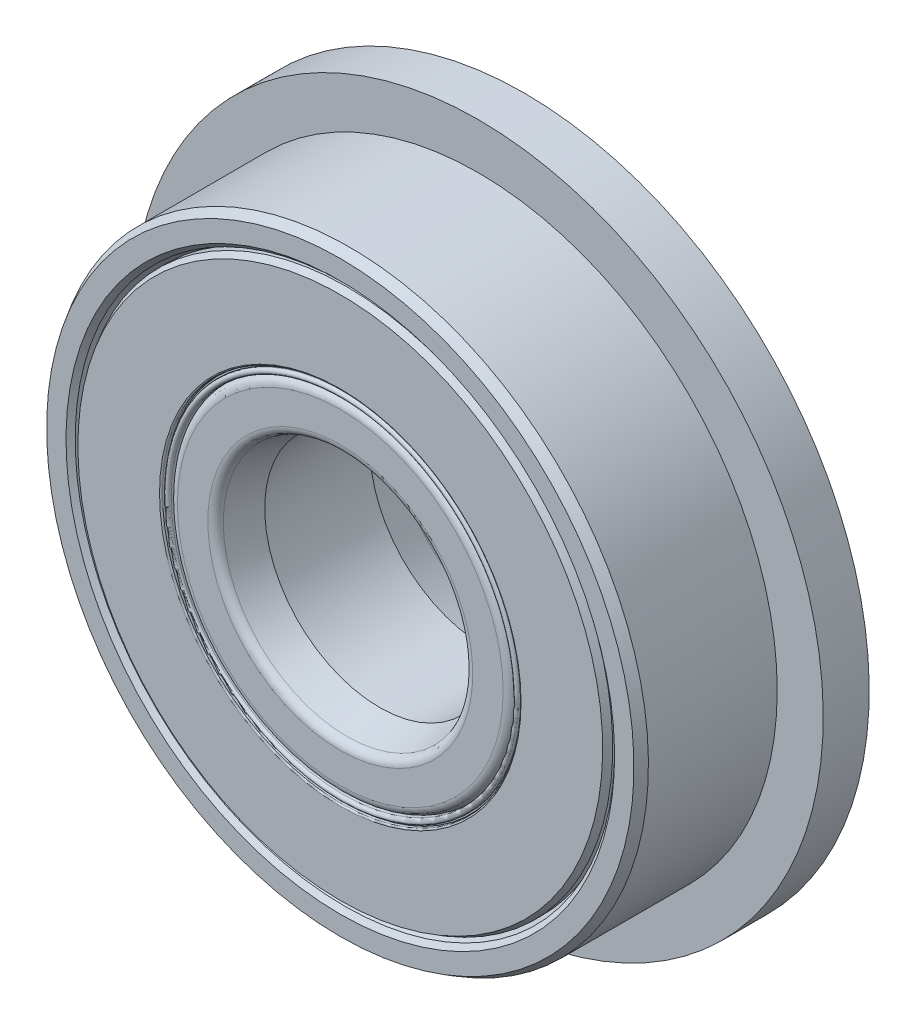
ISO-10303-21;
HEADER;
FILE_DESCRIPTION(('STEP AP214'),'2;1');
FILE_NAME('part.step','',(''),(''),'','','');
FILE_SCHEMA(('AUTOMOTIVE_DESIGN { 1 0 10303 214 1 1 1 1 }'));
ENDSEC;
DATA;
#1=APPLICATION_CONTEXT('core data for automotive mechanical design processes');
#2=APPLICATION_PROTOCOL_DEFINITION('international standard','automotive_design',2000,#1);
#3=PRODUCT_CONTEXT('',#1,'mechanical');
#4=PRODUCT('Part','Part','',(#3));
#5=PRODUCT_RELATED_PRODUCT_CATEGORY('part','',(#4));
#6=PRODUCT_DEFINITION_FORMATION('','',#4);
#7=PRODUCT_DEFINITION_CONTEXT('part definition',#1,'design');
#8=PRODUCT_DEFINITION('design','',#6,#7);
#9=PRODUCT_DEFINITION_SHAPE('','',#8);
#10=(LENGTH_UNIT() NAMED_UNIT(*) SI_UNIT(.MILLI.,.METRE.));
#11=(NAMED_UNIT(*) PLANE_ANGLE_UNIT() SI_UNIT($,.RADIAN.));
#12=(NAMED_UNIT(*) SI_UNIT($,.STERADIAN.) SOLID_ANGLE_UNIT());
#13=UNCERTAINTY_MEASURE_WITH_UNIT(LENGTH_MEASURE(1.E-05),#10,'distance_accuracy_value','');
#14=(GEOMETRIC_REPRESENTATION_CONTEXT(3) GLOBAL_UNCERTAINTY_ASSIGNED_CONTEXT((#13)) GLOBAL_UNIT_ASSIGNED_CONTEXT((#10,
#11,#12)) REPRESENTATION_CONTEXT('',''));
#15=CARTESIAN_POINT('',(0.,0.,0.));
#16=DIRECTION('',(0.,0.,1.));
#17=DIRECTION('',(1.,0.,0.));
#18=AXIS2_PLACEMENT_3D('',#15,#16,#17);
#19=CARTESIAN_POINT('',(0.,3.73833333333333,1.5));
#20=DIRECTION('',(0.,0.,1.));
#21=DIRECTION('',(0.,-1.,0.));
#22=AXIS2_PLACEMENT_3D('',#19,#20,#21);
#23=PLANE('',#22);
#24=CARTESIAN_POINT('',(0.,0.,1.5));
#25=DIRECTION('',(0.,0.,1.));
#26=DIRECTION('',(0.,-1.,0.));
#27=AXIS2_PLACEMENT_3D('',#24,#25,#26);
#28=CIRCLE('',#27,3.89833333333333);
#29=CARTESIAN_POINT('',(0.,-3.89833333333333,1.5));
#30=VERTEX_POINT('',#29);
#31=EDGE_CURVE('E11',#30,#30,#28,.T.);
#32=ORIENTED_EDGE('',*,*,#31,.F.);
#33=EDGE_LOOP('',(#32));
#34=FACE_BOUND('',#33,.T.);
#35=CARTESIAN_POINT('',(0.,0.,1.5));
#36=DIRECTION('',(0.,0.,1.));
#37=DIRECTION('',(0.,-1.,0.));
#38=AXIS2_PLACEMENT_3D('',#35,#36,#37);
#39=CIRCLE('',#38,3.73833333333333);
#40=CARTESIAN_POINT('',(0.,-3.73833333333333,1.5));
#41=VERTEX_POINT('',#40);
#42=EDGE_CURVE('E67',#41,#41,#39,.T.);
#43=ORIENTED_EDGE('',*,*,#42,.T.);
#44=EDGE_LOOP('',(#43));
#45=FACE_BOUND('',#44,.T.);
#46=ADVANCED_FACE('F42',(#34,#45),#23,.F.);
#47=CARTESIAN_POINT('',(0.,0.,2.));
#48=DIRECTION('',(0.,0.,1.));
#49=DIRECTION('',(0.,-1.,0.));
#50=AXIS2_PLACEMENT_3D('',#47,#48,#49);
#51=CYLINDRICAL_SURFACE('',#50,3.89833333333333);
#52=CARTESIAN_POINT('',(0.,0.,1.87849954654104));
#53=DIRECTION('',(0.,0.,1.));
#54=DIRECTION('',(0.,-1.,0.));
#55=AXIS2_PLACEMENT_3D('',#52,#53,#54);
#56=CIRCLE('',#55,3.89833333333333);
#57=CARTESIAN_POINT('',(0.,-3.89833333333333,1.87849954654104));
#58=VERTEX_POINT('',#57);
#59=EDGE_CURVE('E48',#58,#58,#56,.T.);
#60=ORIENTED_EDGE('',*,*,#59,.F.);
#61=EDGE_LOOP('',(#60));
#62=FACE_BOUND('',#61,.T.);
#63=ORIENTED_EDGE('',*,*,#31,.T.);
#64=EDGE_LOOP('',(#63));
#65=FACE_BOUND('',#64,.T.);
#66=ADVANCED_FACE('F98',(#62,#65),#51,.T.);
#67=CARTESIAN_POINT('',(0.,0.,1.87849954654104));
#68=DIRECTION('',(0.,0.,-1.));
#69=DIRECTION('',(0.,1.,0.));
#70=AXIS2_PLACEMENT_3D('',#67,#68,#69);
#71=CONICAL_SURFACE('',#70,3.89833333333333,0.174532925199437);
#72=CARTESIAN_POINT('',(0.,0.,1.91789185666153));
#73=DIRECTION('',(0.,0.,1.));
#74=DIRECTION('',(0.,-1.,0.));
#75=AXIS2_PLACEMENT_3D('',#72,#73,#74);
#76=CIRCLE('',#75,3.89138740622665);
#77=CARTESIAN_POINT('',(0.,-3.89138740622665,1.91789185666153));
#78=VERTEX_POINT('',#77);
#79=EDGE_CURVE('E52',#78,#78,#76,.T.);
#80=ORIENTED_EDGE('',*,*,#79,.F.);
#81=EDGE_LOOP('',(#80));
#82=FACE_BOUND('',#81,.T.);
#83=ORIENTED_EDGE('',*,*,#59,.T.);
#84=EDGE_LOOP('',(#83));
#85=FACE_BOUND('',#84,.T.);
#86=ADVANCED_FACE('F93',(#82,#85),#71,.T.);
#87=CARTESIAN_POINT('',(0.,0.,1.915));
#88=DIRECTION('',(0.,0.,1.));
#89=DIRECTION('',(0.,-1.,0.));
#90=AXIS2_PLACEMENT_3D('',#87,#88,#89);
#91=TOROIDAL_SURFACE('',#90,3.8749868721172,0.016653538783874);
#92=CARTESIAN_POINT('',(0.,0.,1.915));
#93=DIRECTION('',(0.,0.,1.));
#94=DIRECTION('',(0.,-1.,0.));
#95=AXIS2_PLACEMENT_3D('',#92,#93,#94);
#96=CIRCLE('',#95,3.85833333333333);
#97=CARTESIAN_POINT('',(0.,-3.85833333333333,1.915));
#98=VERTEX_POINT('',#97);
#99=EDGE_CURVE('E56',#98,#98,#96,.T.);
#100=ORIENTED_EDGE('',*,*,#99,.F.);
#101=EDGE_LOOP('',(#100));
#102=FACE_BOUND('',#101,.T.);
#103=ORIENTED_EDGE('',*,*,#79,.T.);
#104=EDGE_LOOP('',(#103));
#105=FACE_BOUND('',#104,.T.);
#106=ADVANCED_FACE('F87',(#102,#105),#91,.T.);
#107=CARTESIAN_POINT('',(0.,0.,2.));
#108=DIRECTION('',(0.,0.,1.));
#109=DIRECTION('',(0.,-1.,0.));
#110=AXIS2_PLACEMENT_3D('',#107,#108,#109);
#111=CYLINDRICAL_SURFACE('',#110,3.85833333333333);
#112=CARTESIAN_POINT('',(0.,0.,1.94));
#113=DIRECTION('',(0.,0.,1.));
#114=DIRECTION('',(0.,-1.,0.));
#115=AXIS2_PLACEMENT_3D('',#112,#113,#114);
#116=CIRCLE('',#115,3.85833333333333);
#117=CARTESIAN_POINT('',(0.,-3.85833333333333,1.94));
#118=VERTEX_POINT('',#117);
#119=EDGE_CURVE('E61',#118,#118,#116,.T.);
#120=ORIENTED_EDGE('',*,*,#119,.F.);
#121=EDGE_LOOP('',(#120));
#122=FACE_BOUND('',#121,.T.);
#123=ORIENTED_EDGE('',*,*,#99,.T.);
#124=EDGE_LOOP('',(#123));
#125=FACE_BOUND('',#124,.T.);
#126=ADVANCED_FACE('F81',(#122,#125),#111,.T.);
#127=CARTESIAN_POINT('',(0.,0.,1.94));
#128=DIRECTION('',(0.,0.,1.));
#129=DIRECTION('',(0.,-1.,0.));
#130=AXIS2_PLACEMENT_3D('',#127,#128,#129);
#131=TOROIDAL_SURFACE('',#130,3.79833333333333,0.0599999999999997);
#132=CARTESIAN_POINT('',(0.,0.,1.94));
#133=DIRECTION('',(0.,0.,1.));
#134=DIRECTION('',(0.,-1.,0.));
#135=AXIS2_PLACEMENT_3D('',#132,#133,#134);
#136=CIRCLE('',#135,3.73833333333333);
#137=CARTESIAN_POINT('',(0.,-3.73833333333333,1.94));
#138=VERTEX_POINT('',#137);
#139=EDGE_CURVE('E64',#138,#138,#136,.T.);
#140=ORIENTED_EDGE('',*,*,#139,.F.);
#141=EDGE_LOOP('',(#140));
#142=FACE_BOUND('',#141,.T.);
#143=ORIENTED_EDGE('',*,*,#119,.T.);
#144=EDGE_LOOP('',(#143));
#145=FACE_BOUND('',#144,.T.);
#146=ADVANCED_FACE('F75',(#142,#145),#131,.T.);
#147=CARTESIAN_POINT('',(0.,0.,2.));
#148=DIRECTION('',(0.,0.,1.));
#149=DIRECTION('',(0.,-1.,0.));
#150=AXIS2_PLACEMENT_3D('',#147,#148,#149);
#151=CYLINDRICAL_SURFACE('',#150,3.73833333333333);
#152=ORIENTED_EDGE('',*,*,#42,.F.);
#153=EDGE_LOOP('',(#152));
#154=FACE_BOUND('',#153,.T.);
#155=ORIENTED_EDGE('',*,*,#139,.T.);
#156=EDGE_LOOP('',(#155));
#157=FACE_BOUND('',#156,.T.);
#158=ADVANCED_FACE('F72',(#154,#157),#151,.F.);
#159=CLOSED_SHELL('',(#46,#66,#86,#106,#126,#146,#158));
#160=MANIFOLD_SOLID_BREP('B2',#159);
#161=CARTESIAN_POINT('',(0.,0.,-2.00000000000001));
#162=DIRECTION('',(0.,0.,1.));
#163=DIRECTION('',(0.,-1.,0.));
#164=AXIS2_PLACEMENT_3D('',#161,#162,#163);
#165=CONICAL_SURFACE('',#164,5.705,0.523598775598299);
#166=CARTESIAN_POINT('',(0.,0.,-1.8614359353945));
#167=DIRECTION('',(0.,0.,1.));
#168=DIRECTION('',(0.,-1.,0.));
#169=AXIS2_PLACEMENT_3D('',#166,#167,#168);
#170=CIRCLE('',#169,5.785);
#171=CARTESIAN_POINT('',(0.,-5.785,-1.8614359353945));
#172=VERTEX_POINT('',#171);
#173=EDGE_CURVE('E179',#172,#172,#170,.T.);
#174=ORIENTED_EDGE('',*,*,#173,.F.);
#175=EDGE_LOOP('',(#174));
#176=FACE_BOUND('',#175,.T.);
#177=CARTESIAN_POINT('',(0.,0.,-2.00000000000001));
#178=DIRECTION('',(0.,0.,1.));
#179=DIRECTION('',(0.,-1.,0.));
#180=AXIS2_PLACEMENT_3D('',#177,#178,#179);
#181=CIRCLE('',#180,5.705);
#182=CARTESIAN_POINT('',(0.,-5.705,-2.00000000000001));
#183=VERTEX_POINT('',#182);
#184=EDGE_CURVE('E41',#183,#183,#181,.T.);
#185=ORIENTED_EDGE('',*,*,#184,.T.);
#186=EDGE_LOOP('',(#185));
#187=FACE_BOUND('',#186,.T.);
#188=ADVANCED_FACE('F157',(#176,#187),#165,.T.);
#189=CARTESIAN_POINT('',(0.,5.705,-2.00000000000001));
#190=DIRECTION('',(0.,0.,1.));
#191=DIRECTION('',(0.,-1.,0.));
#192=AXIS2_PLACEMENT_3D('',#189,#190,#191);
#193=PLANE('',#192);
#194=ORIENTED_EDGE('',*,*,#184,.F.);
#195=EDGE_LOOP('',(#194));
#196=FACE_BOUND('',#195,.T.);
#197=CARTESIAN_POINT('',(0.,0.,-2.00000000000001));
#198=DIRECTION('',(0.,0.,1.));
#199=DIRECTION('',(0.,-1.,0.));
#200=AXIS2_PLACEMENT_3D('',#197,#198,#199);
#201=CIRCLE('',#200,3.93033333333333);
#202=CARTESIAN_POINT('',(0.,-3.93033333333333,-2.00000000000001));
#203=VERTEX_POINT('',#202);
#204=EDGE_CURVE('E163',#203,#203,#201,.T.);
#205=ORIENTED_EDGE('',*,*,#204,.T.);
#206=EDGE_LOOP('',(#205));
#207=FACE_BOUND('',#206,.T.);
#208=ADVANCED_FACE('F186',(#196,#207),#193,.F.);
#209=CARTESIAN_POINT('',(0.,0.,-1.96800000000001));
#210=DIRECTION('',(0.,0.,1.));
#211=DIRECTION('',(0.,-1.,0.));
#212=AXIS2_PLACEMENT_3D('',#209,#210,#211);
#213=TOROIDAL_SURFACE('',#212,3.93033333333333,0.0320000000000006);
#214=ORIENTED_EDGE('',*,*,#204,.F.);
#215=EDGE_LOOP('',(#214));
#216=FACE_BOUND('',#215,.T.);
#217=CARTESIAN_POINT('',(0.,0.,-1.96800000000001));
#218=DIRECTION('',(0.,0.,1.));
#219=DIRECTION('',(0.,-1.,0.));
#220=AXIS2_PLACEMENT_3D('',#217,#218,#219);
#221=CIRCLE('',#220,3.89833333333333);
#222=CARTESIAN_POINT('',(0.,-3.89833333333333,-1.96800000000001));
#223=VERTEX_POINT('',#222);
#224=EDGE_CURVE('E167',#223,#223,#221,.T.);
#225=ORIENTED_EDGE('',*,*,#224,.T.);
#226=EDGE_LOOP('',(#225));
#227=FACE_BOUND('',#226,.T.);
#228=ADVANCED_FACE('F190',(#216,#227),#213,.T.);
#229=CARTESIAN_POINT('',(0.,0.,2.));
#230=DIRECTION('',(0.,0.,1.));
#231=DIRECTION('',(0.,-1.,0.));
#232=AXIS2_PLACEMENT_3D('',#229,#230,#231);
#233=CYLINDRICAL_SURFACE('',#232,3.89833333333333);
#234=ORIENTED_EDGE('',*,*,#224,.F.);
#235=EDGE_LOOP('',(#234));
#236=FACE_BOUND('',#235,.T.);
#237=CARTESIAN_POINT('',(0.,0.,-1.5));
#238=DIRECTION('',(0.,0.,1.));
#239=DIRECTION('',(0.,-1.,0.));
#240=AXIS2_PLACEMENT_3D('',#237,#238,#239);
#241=CIRCLE('',#240,3.89833333333333);
#242=CARTESIAN_POINT('',(0.,-3.89833333333333,-1.5));
#243=VERTEX_POINT('',#242);
#244=EDGE_CURVE('E171',#243,#243,#241,.T.);
#245=ORIENTED_EDGE('',*,*,#244,.T.);
#246=EDGE_LOOP('',(#245));
#247=FACE_BOUND('',#246,.T.);
#248=ADVANCED_FACE('F195',(#236,#247),#233,.F.);
#249=CARTESIAN_POINT('',(0.,5.785,-1.5));
#250=DIRECTION('',(0.,0.,-1.));
#251=DIRECTION('',(0.,1.,0.));
#252=AXIS2_PLACEMENT_3D('',#249,#250,#251);
#253=PLANE('',#252);
#254=ORIENTED_EDGE('',*,*,#244,.F.);
#255=EDGE_LOOP('',(#254));
#256=FACE_BOUND('',#255,.T.);
#257=CARTESIAN_POINT('',(0.,0.,-1.5));
#258=DIRECTION('',(0.,0.,1.));
#259=DIRECTION('',(0.,-1.,0.));
#260=AXIS2_PLACEMENT_3D('',#257,#258,#259);
#261=CIRCLE('',#260,5.785);
#262=CARTESIAN_POINT('',(0.,-5.785,-1.5));
#263=VERTEX_POINT('',#262);
#264=EDGE_CURVE('E176',#263,#263,#261,.T.);
#265=ORIENTED_EDGE('',*,*,#264,.T.);
#266=EDGE_LOOP('',(#265));
#267=FACE_BOUND('',#266,.T.);
#268=ADVANCED_FACE('F201',(#256,#267),#253,.F.);
#269=CARTESIAN_POINT('',(0.,0.,2.));
#270=DIRECTION('',(0.,0.,1.));
#271=DIRECTION('',(0.,-1.,0.));
#272=AXIS2_PLACEMENT_3D('',#269,#270,#271);
#273=CYLINDRICAL_SURFACE('',#272,5.785);
#274=ORIENTED_EDGE('',*,*,#264,.F.);
#275=EDGE_LOOP('',(#274));
#276=FACE_BOUND('',#275,.T.);
#277=ORIENTED_EDGE('',*,*,#173,.T.);
#278=EDGE_LOOP('',(#277));
#279=FACE_BOUND('',#278,.T.);
#280=ADVANCED_FACE('F183',(#276,#279),#273,.T.);
#281=CLOSED_SHELL('',(#188,#208,#228,#248,#268,#280));
#282=MANIFOLD_SOLID_BREP('B6',#281);
#283=CARTESIAN_POINT('',(0.,5.785,1.5));
#284=DIRECTION('',(0.,0.,1.));
#285=DIRECTION('',(0.,-1.,0.));
#286=AXIS2_PLACEMENT_3D('',#283,#284,#285);
#287=PLANE('',#286);
#288=CARTESIAN_POINT('',(0.,0.,1.5));
#289=DIRECTION('',(0.,0.,1.));
#290=DIRECTION('',(0.,-1.,0.));
#291=AXIS2_PLACEMENT_3D('',#288,#289,#290);
#292=CIRCLE('',#291,5.785);
#293=CARTESIAN_POINT('',(0.,-5.785,1.5));
#294=VERTEX_POINT('',#293);
#295=EDGE_CURVE('E156',#294,#294,#292,.T.);
#296=ORIENTED_EDGE('',*,*,#295,.F.);
#297=EDGE_LOOP('',(#296));
#298=FACE_BOUND('',#297,.T.);
#299=CARTESIAN_POINT('',(0.,0.,1.5));
#300=DIRECTION('',(0.,0.,1.));
#301=DIRECTION('',(0.,-1.,0.));
#302=AXIS2_PLACEMENT_3D('',#299,#300,#301);
#303=CIRCLE('',#302,3.89833333333333);
#304=CARTESIAN_POINT('',(0.,-3.89833333333333,1.5));
#305=VERTEX_POINT('',#304);
#306=EDGE_CURVE('E279',#305,#305,#303,.T.);
#307=ORIENTED_EDGE('',*,*,#306,.T.);
#308=EDGE_LOOP('',(#307));
#309=FACE_BOUND('',#308,.T.);
#310=ADVANCED_FACE('F257',(#298,#309),#287,.F.);
#311=CARTESIAN_POINT('',(0.,0.,2.));
#312=DIRECTION('',(0.,0.,1.));
#313=DIRECTION('',(0.,-1.,0.));
#314=AXIS2_PLACEMENT_3D('',#311,#312,#313);
#315=CYLINDRICAL_SURFACE('',#314,5.785);
#316=CARTESIAN_POINT('',(0.,0.,1.86143593539449));
#317=DIRECTION('',(0.,0.,1.));
#318=DIRECTION('',(0.,-1.,0.));
#319=AXIS2_PLACEMENT_3D('',#316,#317,#318);
#320=CIRCLE('',#319,5.785);
#321=CARTESIAN_POINT('',(0.,-5.785,1.86143593539449));
#322=VERTEX_POINT('',#321);
#323=EDGE_CURVE('E263',#322,#322,#320,.T.);
#324=ORIENTED_EDGE('',*,*,#323,.F.);
#325=EDGE_LOOP('',(#324));
#326=FACE_BOUND('',#325,.T.);
#327=ORIENTED_EDGE('',*,*,#295,.T.);
#328=EDGE_LOOP('',(#327));
#329=FACE_BOUND('',#328,.T.);
#330=ADVANCED_FACE('F304',(#326,#329),#315,.T.);
#331=CARTESIAN_POINT('',(0.,0.,1.86143593539449));
#332=DIRECTION('',(0.,0.,-1.));
#333=DIRECTION('',(0.,1.,0.));
#334=AXIS2_PLACEMENT_3D('',#331,#332,#333);
#335=CONICAL_SURFACE('',#334,5.785,0.523598775598298);
#336=CARTESIAN_POINT('',(0.,0.,2.));
#337=DIRECTION('',(0.,0.,1.));
#338=DIRECTION('',(0.,-1.,0.));
#339=AXIS2_PLACEMENT_3D('',#336,#337,#338);
#340=CIRCLE('',#339,5.705);
#341=CARTESIAN_POINT('',(0.,-5.705,2.));
#342=VERTEX_POINT('',#341);
#343=EDGE_CURVE('E267',#342,#342,#340,.T.);
#344=ORIENTED_EDGE('',*,*,#343,.F.);
#345=EDGE_LOOP('',(#344));
#346=FACE_BOUND('',#345,.T.);
#347=ORIENTED_EDGE('',*,*,#323,.T.);
#348=EDGE_LOOP('',(#347));
#349=FACE_BOUND('',#348,.T.);
#350=ADVANCED_FACE('F299',(#346,#349),#335,.T.);
#351=CARTESIAN_POINT('',(0.,5.705,2.));
#352=DIRECTION('',(0.,0.,-1.));
#353=DIRECTION('',(0.,1.,0.));
#354=AXIS2_PLACEMENT_3D('',#351,#352,#353);
#355=PLANE('',#354);
#356=CARTESIAN_POINT('',(0.,0.,2.));
#357=DIRECTION('',(0.,0.,1.));
#358=DIRECTION('',(0.,-1.,0.));
#359=AXIS2_PLACEMENT_3D('',#356,#357,#358);
#360=CIRCLE('',#359,3.93033333333333);
#361=CARTESIAN_POINT('',(0.,-3.93033333333333,2.));
#362=VERTEX_POINT('',#361);
#363=EDGE_CURVE('E271',#362,#362,#360,.T.);
#364=ORIENTED_EDGE('',*,*,#363,.F.);
#365=EDGE_LOOP('',(#364));
#366=FACE_BOUND('',#365,.T.);
#367=ORIENTED_EDGE('',*,*,#343,.T.);
#368=EDGE_LOOP('',(#367));
#369=FACE_BOUND('',#368,.T.);
#370=ADVANCED_FACE('F293',(#366,#369),#355,.F.);
#371=CARTESIAN_POINT('',(0.,0.,1.968));
#372=DIRECTION('',(0.,0.,1.));
#373=DIRECTION('',(0.,-1.,0.));
#374=AXIS2_PLACEMENT_3D('',#371,#372,#373);
#375=TOROIDAL_SURFACE('',#374,3.93033333333333,0.0320000000000001);
#376=CARTESIAN_POINT('',(0.,0.,1.968));
#377=DIRECTION('',(0.,0.,1.));
#378=DIRECTION('',(0.,-1.,0.));
#379=AXIS2_PLACEMENT_3D('',#376,#377,#378);
#380=CIRCLE('',#379,3.89833333333333);
#381=CARTESIAN_POINT('',(0.,-3.89833333333333,1.968));
#382=VERTEX_POINT('',#381);
#383=EDGE_CURVE('E276',#382,#382,#380,.T.);
#384=ORIENTED_EDGE('',*,*,#383,.F.);
#385=EDGE_LOOP('',(#384));
#386=FACE_BOUND('',#385,.T.);
#387=ORIENTED_EDGE('',*,*,#363,.T.);
#388=EDGE_LOOP('',(#387));
#389=FACE_BOUND('',#388,.T.);
#390=ADVANCED_FACE('F287',(#386,#389),#375,.T.);
#391=CARTESIAN_POINT('',(0.,0.,2.));
#392=DIRECTION('',(0.,0.,1.));
#393=DIRECTION('',(0.,-1.,0.));
#394=AXIS2_PLACEMENT_3D('',#391,#392,#393);
#395=CYLINDRICAL_SURFACE('',#394,3.89833333333333);
#396=ORIENTED_EDGE('',*,*,#306,.F.);
#397=EDGE_LOOP('',(#396));
#398=FACE_BOUND('',#397,.T.);
#399=ORIENTED_EDGE('',*,*,#383,.T.);
#400=EDGE_LOOP('',(#399));
#401=FACE_BOUND('',#400,.T.);
#402=ADVANCED_FACE('F284',(#398,#401),#395,.F.);
#403=CLOSED_SHELL('',(#310,#330,#350,#370,#390,#402));
#404=MANIFOLD_SOLID_BREP('B36',#403);
#405=CARTESIAN_POINT('',(0.,0.,-1.80286616064692));
#406=DIRECTION('',(0.,0.,1.));
#407=DIRECTION('',(0.,-1.,0.));
#408=AXIS2_PLACEMENT_3D('',#405,#406,#407);
#409=TOROIDAL_SURFACE('',#408,2.88083333333333,0.197133839353085);
#410=CARTESIAN_POINT('',(0.,0.,-2.));
#411=DIRECTION('',(0.,0.,1.));
#412=DIRECTION('',(0.,-1.,0.));
#413=AXIS2_PLACEMENT_3D('',#410,#411,#412);
#414=CIRCLE('',#413,2.88083333333333);
#415=CARTESIAN_POINT('',(0.,-2.88083333333333,-2.));
#416=VERTEX_POINT('',#415);
#417=EDGE_CURVE('E256',#416,#416,#414,.T.);
#418=ORIENTED_EDGE('',*,*,#417,.F.);
#419=EDGE_LOOP('',(#418));
#420=FACE_BOUND('',#419,.T.);
#421=CARTESIAN_POINT('',(0.,0.,-1.85388815270568));
#422=DIRECTION('',(0.,0.,1.));
#423=DIRECTION('',(0.,-1.,0.));
#424=AXIS2_PLACEMENT_3D('',#421,#422,#423);
#425=CIRCLE('',#424,2.69041666666667);
#426=CARTESIAN_POINT('',(0.,-2.69041666666666,-1.85388815270568));
#427=VERTEX_POINT('',#426);
#428=EDGE_CURVE('E408',#427,#427,#425,.T.);
#429=ORIENTED_EDGE('',*,*,#428,.T.);
#430=EDGE_LOOP('',(#429));
#431=FACE_BOUND('',#430,.T.);
#432=ADVANCED_FACE('F368',(#420,#431),#409,.T.);
#433=CARTESIAN_POINT('',(0.,2.88083333333333,-2.));
#434=DIRECTION('',(0.,0.,1.));
#435=DIRECTION('',(0.,-1.,0.));
#436=AXIS2_PLACEMENT_3D('',#433,#434,#435);
#437=PLANE('',#436);
#438=CARTESIAN_POINT('',(0.,0.,-2.));
#439=DIRECTION('',(0.,0.,1.));
#440=DIRECTION('',(0.,-1.,0.));
#441=AXIS2_PLACEMENT_3D('',#438,#439,#440);
#442=CIRCLE('',#441,3.54119949398024);
#443=CARTESIAN_POINT('',(0.,-3.54119949398024,-2.));
#444=VERTEX_POINT('',#443);
#445=EDGE_CURVE('E374',#444,#444,#442,.T.);
#446=ORIENTED_EDGE('',*,*,#445,.F.);
#447=EDGE_LOOP('',(#446));
#448=FACE_BOUND('',#447,.T.);
#449=ORIENTED_EDGE('',*,*,#417,.T.);
#450=EDGE_LOOP('',(#449));
#451=FACE_BOUND('',#450,.T.);
#452=ADVANCED_FACE('F469',(#448,#451),#437,.F.);
#453=CARTESIAN_POINT('',(0.,0.,-1.80286616064692));
#454=DIRECTION('',(0.,0.,1.));
#455=DIRECTION('',(0.,-1.,0.));
#456=AXIS2_PLACEMENT_3D('',#453,#454,#455);
#457=TOROIDAL_SURFACE('',#456,3.54119949398024,0.197133839353085);
#458=CARTESIAN_POINT('',(0.,0.,-1.80286616064692));
#459=DIRECTION('',(0.,0.,1.));
#460=DIRECTION('',(0.,-1.,0.));
#461=AXIS2_PLACEMENT_3D('',#458,#459,#460);
#462=CIRCLE('',#461,3.73833333333333);
#463=CARTESIAN_POINT('',(0.,-3.73833333333333,-1.80286616064692));
#464=VERTEX_POINT('',#463);
#465=EDGE_CURVE('E378',#464,#464,#462,.T.);
#466=ORIENTED_EDGE('',*,*,#465,.F.);
#467=EDGE_LOOP('',(#466));
#468=FACE_BOUND('',#467,.T.);
#469=ORIENTED_EDGE('',*,*,#445,.T.);
#470=EDGE_LOOP('',(#469));
#471=FACE_BOUND('',#470,.T.);
#472=ADVANCED_FACE('F464',(#468,#471),#457,.T.);
#473=CARTESIAN_POINT('',(0.,0.,2.));
#474=DIRECTION('',(0.,0.,1.));
#475=DIRECTION('',(0.,-1.,0.));
#476=AXIS2_PLACEMENT_3D('',#473,#474,#475);
#477=CYLINDRICAL_SURFACE('',#476,3.73833333333333);
#478=CARTESIAN_POINT('',(0.,0.,-1.09671732405798));
#479=DIRECTION('',(0.,0.,1.));
#480=DIRECTION('',(0.,-1.,0.));
#481=AXIS2_PLACEMENT_3D('',#478,#479,#480);
#482=CIRCLE('',#481,3.73833333333333);
#483=CARTESIAN_POINT('',(0.,-3.73833333333333,-1.09671732405798));
#484=VERTEX_POINT('',#483);
#485=EDGE_CURVE('E382',#484,#484,#482,.T.);
#486=ORIENTED_EDGE('',*,*,#485,.F.);
#487=EDGE_LOOP('',(#486));
#488=FACE_BOUND('',#487,.T.);
#489=ORIENTED_EDGE('',*,*,#465,.T.);
#490=EDGE_LOOP('',(#489));
#491=FACE_BOUND('',#490,.T.);
#492=ADVANCED_FACE('F458',(#488,#491),#477,.T.);
#493=CARTESIAN_POINT('',(0.,0.,0.));
#494=DIRECTION('',(0.,0.,1.));
#495=DIRECTION('',(0.,-1.,0.));
#496=AXIS2_PLACEMENT_3D('',#493,#494,#495);
#497=TOROIDAL_SURFACE('',#496,4.76166666666667,1.5);
#498=CARTESIAN_POINT('',(0.,0.,1.09671732405797));
#499=DIRECTION('',(0.,0.,1.));
#500=DIRECTION('',(0.,-1.,0.));
#501=AXIS2_PLACEMENT_3D('',#498,#499,#500);
#502=CIRCLE('',#501,3.73833333333333);
#503=CARTESIAN_POINT('',(0.,-3.73833333333333,1.09671732405797));
#504=VERTEX_POINT('',#503);
#505=EDGE_CURVE('E387',#504,#504,#502,.T.);
#506=ORIENTED_EDGE('',*,*,#505,.F.);
#507=EDGE_LOOP('',(#506));
#508=FACE_BOUND('',#507,.T.);
#509=ORIENTED_EDGE('',*,*,#485,.T.);
#510=EDGE_LOOP('',(#509));
#511=FACE_BOUND('',#510,.T.);
#512=ADVANCED_FACE('F452',(#508,#511),#497,.F.);
#513=CARTESIAN_POINT('',(0.,0.,2.));
#514=DIRECTION('',(0.,0.,1.));
#515=DIRECTION('',(0.,-1.,0.));
#516=AXIS2_PLACEMENT_3D('',#513,#514,#515);
#517=CYLINDRICAL_SURFACE('',#516,3.73833333333333);
#518=CARTESIAN_POINT('',(0.,0.,1.80286616064692));
#519=DIRECTION('',(0.,0.,1.));
#520=DIRECTION('',(0.,-1.,0.));
#521=AXIS2_PLACEMENT_3D('',#518,#519,#520);
#522=CIRCLE('',#521,3.73833333333333);
#523=CARTESIAN_POINT('',(0.,-3.73833333333333,1.80286616064692));
#524=VERTEX_POINT('',#523);
#525=EDGE_CURVE('E390',#524,#524,#522,.T.);
#526=ORIENTED_EDGE('',*,*,#525,.F.);
#527=EDGE_LOOP('',(#526));
#528=FACE_BOUND('',#527,.T.);
#529=ORIENTED_EDGE('',*,*,#505,.T.);
#530=EDGE_LOOP('',(#529));
#531=FACE_BOUND('',#530,.T.);
#532=ADVANCED_FACE('F446',(#528,#531),#517,.T.);
#533=CARTESIAN_POINT('',(0.,0.,1.80286616064692));
#534=DIRECTION('',(0.,0.,1.));
#535=DIRECTION('',(0.,-1.,0.));
#536=AXIS2_PLACEMENT_3D('',#533,#534,#535);
#537=TOROIDAL_SURFACE('',#536,3.54119949398025,0.197133839353085);
#538=CARTESIAN_POINT('',(0.,0.,2.));
#539=DIRECTION('',(0.,0.,1.));
#540=DIRECTION('',(0.,-1.,0.));
#541=AXIS2_PLACEMENT_3D('',#538,#539,#540);
#542=CIRCLE('',#541,3.54119949398025);
#543=CARTESIAN_POINT('',(0.,-3.54119949398025,2.));
#544=VERTEX_POINT('',#543);
#545=EDGE_CURVE('E393',#544,#544,#542,.T.);
#546=ORIENTED_EDGE('',*,*,#545,.F.);
#547=EDGE_LOOP('',(#546));
#548=FACE_BOUND('',#547,.T.);
#549=ORIENTED_EDGE('',*,*,#525,.T.);
#550=EDGE_LOOP('',(#549));
#551=FACE_BOUND('',#550,.T.);
#552=ADVANCED_FACE('F440',(#548,#551),#537,.T.);
#553=CARTESIAN_POINT('',(0.,2.88083333333333,2.));
#554=DIRECTION('',(0.,0.,-1.));
#555=DIRECTION('',(0.,1.,0.));
#556=AXIS2_PLACEMENT_3D('',#553,#554,#555);
#557=PLANE('',#556);
#558=CARTESIAN_POINT('',(0.,0.,2.));
#559=DIRECTION('',(0.,0.,1.));
#560=DIRECTION('',(0.,-1.,0.));
#561=AXIS2_PLACEMENT_3D('',#558,#559,#560);
#562=CIRCLE('',#561,2.88083333333333);
#563=CARTESIAN_POINT('',(0.,-2.88083333333333,2.));
#564=VERTEX_POINT('',#563);
#565=EDGE_CURVE('E396',#564,#564,#562,.T.);
#566=ORIENTED_EDGE('',*,*,#565,.F.);
#567=EDGE_LOOP('',(#566));
#568=FACE_BOUND('',#567,.T.);
#569=ORIENTED_EDGE('',*,*,#545,.T.);
#570=EDGE_LOOP('',(#569));
#571=FACE_BOUND('',#570,.T.);
#572=ADVANCED_FACE('F434',(#568,#571),#557,.F.);
#573=CARTESIAN_POINT('',(0.,0.,1.80286616064692));
#574=DIRECTION('',(0.,0.,1.));
#575=DIRECTION('',(0.,-1.,0.));
#576=AXIS2_PLACEMENT_3D('',#573,#574,#575);
#577=TOROIDAL_SURFACE('',#576,2.88083333333333,0.197133839353086);
#578=CARTESIAN_POINT('',(0.,0.,1.85388815270568));
#579=DIRECTION('',(0.,0.,1.));
#580=DIRECTION('',(0.,-1.,0.));
#581=AXIS2_PLACEMENT_3D('',#578,#579,#580);
#582=CIRCLE('',#581,2.69041666666667);
#583=CARTESIAN_POINT('',(0.,-2.69041666666667,1.85388815270568));
#584=VERTEX_POINT('',#583);
#585=EDGE_CURVE('E399',#584,#584,#582,.T.);
#586=ORIENTED_EDGE('',*,*,#585,.F.);
#587=EDGE_LOOP('',(#586));
#588=FACE_BOUND('',#587,.T.);
#589=ORIENTED_EDGE('',*,*,#565,.T.);
#590=EDGE_LOOP('',(#589));
#591=FACE_BOUND('',#590,.T.);
#592=ADVANCED_FACE('F428',(#588,#591),#577,.T.);
#593=CARTESIAN_POINT('',(0.,0.,1.85388815270568));
#594=DIRECTION('',(0.,0.,1.));
#595=DIRECTION('',(0.,-1.,0.));
#596=AXIS2_PLACEMENT_3D('',#593,#594,#595);
#597=CONICAL_SURFACE('',#596,2.69041666666667,0.26179938779915);
#598=CARTESIAN_POINT('',(0.,0.,1.14324347809777));
#599=DIRECTION('',(0.,0.,1.));
#600=DIRECTION('',(0.,-1.,0.));
#601=AXIS2_PLACEMENT_3D('',#598,#599,#600);
#602=CIRCLE('',#601,2.5);
#603=CARTESIAN_POINT('',(0.,-2.5,1.14324347809777));
#604=VERTEX_POINT('',#603);
#605=EDGE_CURVE('E402',#604,#604,#602,.T.);
#606=ORIENTED_EDGE('',*,*,#605,.F.);
#607=EDGE_LOOP('',(#606));
#608=FACE_BOUND('',#607,.T.);
#609=ORIENTED_EDGE('',*,*,#585,.T.);
#610=EDGE_LOOP('',(#609));
#611=FACE_BOUND('',#610,.T.);
#612=ADVANCED_FACE('F422',(#608,#611),#597,.F.);
#613=CARTESIAN_POINT('',(0.,0.,2.));
#614=DIRECTION('',(0.,0.,1.));
#615=DIRECTION('',(0.,-1.,0.));
#616=AXIS2_PLACEMENT_3D('',#613,#614,#615);
#617=CYLINDRICAL_SURFACE('',#616,2.5);
#618=CARTESIAN_POINT('',(0.,0.,-1.14324347809778));
#619=DIRECTION('',(0.,0.,1.));
#620=DIRECTION('',(0.,-1.,0.));
#621=AXIS2_PLACEMENT_3D('',#618,#619,#620);
#622=CIRCLE('',#621,2.5);
#623=CARTESIAN_POINT('',(0.,-2.5,-1.14324347809778));
#624=VERTEX_POINT('',#623);
#625=EDGE_CURVE('E405',#624,#624,#622,.T.);
#626=ORIENTED_EDGE('',*,*,#625,.F.);
#627=EDGE_LOOP('',(#626));
#628=FACE_BOUND('',#627,.T.);
#629=ORIENTED_EDGE('',*,*,#605,.T.);
#630=EDGE_LOOP('',(#629));
#631=FACE_BOUND('',#630,.T.);
#632=ADVANCED_FACE('F416',(#628,#631),#617,.F.);
#633=CARTESIAN_POINT('',(0.,0.,-1.14324347809778));
#634=DIRECTION('',(0.,0.,-1.));
#635=DIRECTION('',(0.,1.,0.));
#636=AXIS2_PLACEMENT_3D('',#633,#634,#635);
#637=CONICAL_SURFACE('',#636,2.5,0.261799387799151);
#638=ORIENTED_EDGE('',*,*,#428,.F.);
#639=EDGE_LOOP('',(#638));
#640=FACE_BOUND('',#639,.T.);
#641=ORIENTED_EDGE('',*,*,#625,.T.);
#642=EDGE_LOOP('',(#641));
#643=FACE_BOUND('',#642,.T.);
#644=ADVANCED_FACE('F413',(#640,#643),#637,.F.);
#645=CLOSED_SHELL('',(#432,#452,#472,#492,#512,#532,#552,#572,#592,#612,#632,#644));
#646=MANIFOLD_SOLID_BREP('B151',#645);
#647=CARTESIAN_POINT('',(0.,0.,2.));
#648=DIRECTION('',(0.,0.,1.));
#649=DIRECTION('',(0.,-1.,0.));
#650=AXIS2_PLACEMENT_3D('',#647,#648,#649);
#651=CYLINDRICAL_SURFACE('',#650,6.5);
#652=CARTESIAN_POINT('',(0.,0.,1.8));
#653=DIRECTION('',(0.,0.,1.));
#654=DIRECTION('',(0.,-1.,0.));
#655=AXIS2_PLACEMENT_3D('',#652,#653,#654);
#656=CIRCLE('',#655,6.5);
#657=CARTESIAN_POINT('',(0.,-6.5,1.8));
#658=VERTEX_POINT('',#657);
#659=EDGE_CURVE('E576',#658,#658,#656,.T.);
#660=ORIENTED_EDGE('',*,*,#659,.F.);
#661=EDGE_LOOP('',(#660));
#662=FACE_BOUND('',#661,.T.);
#663=CARTESIAN_POINT('',(0.,0.,-1.));
#664=DIRECTION('',(0.,0.,-1.));
#665=DIRECTION('',(0.,1.,0.));
#666=AXIS2_PLACEMENT_3D('',#663,#664,#665);
#667=CIRCLE('',#666,6.5);
#668=CARTESIAN_POINT('',(0.,6.5,-1.));
#669=VERTEX_POINT('',#668);
#670=EDGE_CURVE('E367',#669,#669,#667,.T.);
#671=ORIENTED_EDGE('',*,*,#670,.F.);
#672=EDGE_LOOP('',(#671));
#673=FACE_BOUND('',#672,.T.);
#674=ADVANCED_FACE('F550',(#662,#673),#651,.T.);
#675=CARTESIAN_POINT('',(0.,0.,2.));
#676=DIRECTION('',(0.,0.,1.));
#677=DIRECTION('',(0.,-1.,0.));
#678=AXIS2_PLACEMENT_3D('',#675,#676,#677);
#679=CYLINDRICAL_SURFACE('',#678,5.785);
#680=CARTESIAN_POINT('',(0.,0.,1.09671732405797));
#681=DIRECTION('',(0.,0.,1.));
#682=DIRECTION('',(0.,-1.,0.));
#683=AXIS2_PLACEMENT_3D('',#680,#681,#682);
#684=CIRCLE('',#683,5.785);
#685=CARTESIAN_POINT('',(0.,-5.785,1.09671732405797));
#686=VERTEX_POINT('',#685);
#687=EDGE_CURVE('E557',#686,#686,#684,.T.);
#688=ORIENTED_EDGE('',*,*,#687,.F.);
#689=EDGE_LOOP('',(#688));
#690=FACE_BOUND('',#689,.T.);
#691=CARTESIAN_POINT('',(0.,0.,1.6829872849735));
#692=DIRECTION('',(0.,0.,1.));
#693=DIRECTION('',(0.,-1.,0.));
#694=AXIS2_PLACEMENT_3D('',#691,#692,#693);
#695=CIRCLE('',#694,5.785);
#696=CARTESIAN_POINT('',(0.,-5.785,1.6829872849735));
#697=VERTEX_POINT('',#696);
#698=EDGE_CURVE('E588',#697,#697,#695,.T.);
#699=ORIENTED_EDGE('',*,*,#698,.T.);
#700=EDGE_LOOP('',(#699));
#701=FACE_BOUND('',#700,.T.);
#702=ADVANCED_FACE('F552',(#690,#701),#679,.F.);
#703=CARTESIAN_POINT('',(0.,0.,0.));
#704=DIRECTION('',(0.,0.,1.));
#705=DIRECTION('',(0.,-1.,0.));
#706=AXIS2_PLACEMENT_3D('',#703,#704,#705);
#707=TOROIDAL_SURFACE('',#706,4.76166666666667,1.5);
#708=CARTESIAN_POINT('',(0.,0.,-1.09671732405798));
#709=DIRECTION('',(0.,0.,1.));
#710=DIRECTION('',(0.,-1.,0.));
#711=AXIS2_PLACEMENT_3D('',#708,#709,#710);
#712=CIRCLE('',#711,5.785);
#713=CARTESIAN_POINT('',(0.,-5.785,-1.09671732405798));
#714=VERTEX_POINT('',#713);
#715=EDGE_CURVE('E561',#714,#714,#712,.T.);
#716=ORIENTED_EDGE('',*,*,#715,.F.);
#717=EDGE_LOOP('',(#716));
#718=FACE_BOUND('',#717,.T.);
#719=ORIENTED_EDGE('',*,*,#687,.T.);
#720=EDGE_LOOP('',(#719));
#721=FACE_BOUND('',#720,.T.);
#722=ADVANCED_FACE('F615',(#718,#721),#707,.F.);
#723=CARTESIAN_POINT('',(0.,0.,2.));
#724=DIRECTION('',(0.,0.,1.));
#725=DIRECTION('',(0.,-1.,0.));
#726=AXIS2_PLACEMENT_3D('',#723,#724,#725);
#727=CYLINDRICAL_SURFACE('',#726,5.785);
#728=CARTESIAN_POINT('',(0.,0.,-1.68298728497351));
#729=DIRECTION('',(0.,0.,1.));
#730=DIRECTION('',(0.,-1.,0.));
#731=AXIS2_PLACEMENT_3D('',#728,#729,#730);
#732=CIRCLE('',#731,5.785);
#733=CARTESIAN_POINT('',(0.,-5.785,-1.68298728497351));
#734=VERTEX_POINT('',#733);
#735=EDGE_CURVE('E565',#734,#734,#732,.T.);
#736=ORIENTED_EDGE('',*,*,#735,.F.);
#737=EDGE_LOOP('',(#736));
#738=FACE_BOUND('',#737,.T.);
#739=ORIENTED_EDGE('',*,*,#715,.T.);
#740=EDGE_LOOP('',(#739));
#741=FACE_BOUND('',#740,.T.);
#742=ADVANCED_FACE('F634',(#738,#741),#727,.F.);
#743=CARTESIAN_POINT('',(0.,0.,-1.68298728497351));
#744=DIRECTION('',(0.,0.,-1.));
#745=DIRECTION('',(0.,1.,0.));
#746=AXIS2_PLACEMENT_3D('',#743,#744,#745);
#747=CONICAL_SURFACE('',#746,5.785,0.349065850398862);
#748=CARTESIAN_POINT('',(0.,0.,-1.9));
#749=DIRECTION('',(0.,0.,1.));
#750=DIRECTION('',(0.,-1.,0.));
#751=AXIS2_PLACEMENT_3D('',#748,#749,#750);
#752=CIRCLE('',#751,5.86398616872694);
#753=CARTESIAN_POINT('',(0.,-5.86398616872694,-1.90000000000001));
#754=VERTEX_POINT('',#753);
#755=EDGE_CURVE('E570',#754,#754,#752,.T.);
#756=ORIENTED_EDGE('',*,*,#755,.F.);
#757=EDGE_LOOP('',(#756));
#758=FACE_BOUND('',#757,.T.);
#759=ORIENTED_EDGE('',*,*,#735,.T.);
#760=EDGE_LOOP('',(#759));
#761=FACE_BOUND('',#760,.T.);
#762=ADVANCED_FACE('F630',(#758,#761),#747,.F.);
#763=CARTESIAN_POINT('',(0.,0.,-1.9));
#764=DIRECTION('',(0.,0.,-1.));
#765=DIRECTION('',(0.,1.,0.));
#766=AXIS2_PLACEMENT_3D('',#763,#764,#765);
#767=CONICAL_SURFACE('',#766,5.86398616872694,0.785398163397444);
#768=CARTESIAN_POINT('',(0.,0.,-2.));
#769=DIRECTION('',(0.,0.,1.));
#770=DIRECTION('',(0.,-1.,0.));
#771=AXIS2_PLACEMENT_3D('',#768,#769,#770);
#772=CIRCLE('',#771,5.96398616872694);
#773=CARTESIAN_POINT('',(0.,-5.96398616872694,-2.00000000000001));
#774=VERTEX_POINT('',#773);
#775=EDGE_CURVE('E573',#774,#774,#772,.T.);
#776=ORIENTED_EDGE('',*,*,#775,.F.);
#777=EDGE_LOOP('',(#776));
#778=FACE_BOUND('',#777,.T.);
#779=ORIENTED_EDGE('',*,*,#755,.T.);
#780=EDGE_LOOP('',(#779));
#781=FACE_BOUND('',#780,.T.);
#782=ADVANCED_FACE('F626',(#778,#781),#767,.F.);
#783=CARTESIAN_POINT('',(0.,6.38452994616208,-2.));
#784=DIRECTION('',(0.,0.,1.));
#785=DIRECTION('',(0.,-1.,0.));
#786=AXIS2_PLACEMENT_3D('',#783,#784,#785);
#787=PLANE('',#786);
#788=ORIENTED_EDGE('',*,*,#775,.T.);
#789=EDGE_LOOP('',(#788));
#790=FACE_BOUND('',#789,.T.);
#791=CARTESIAN_POINT('',(0.,0.,-2.));
#792=DIRECTION('',(0.,0.,-1.));
#793=DIRECTION('',(0.,1.,0.));
#794=AXIS2_PLACEMENT_3D('',#791,#792,#793);
#795=CIRCLE('',#794,7.5);
#796=CARTESIAN_POINT('',(0.,7.5,-2.));
#797=VERTEX_POINT('',#796);
#798=EDGE_CURVE('E592',#797,#797,#795,.T.);
#799=ORIENTED_EDGE('',*,*,#798,.T.);
#800=EDGE_LOOP('',(#799));
#801=FACE_BOUND('',#800,.T.);
#802=ADVANCED_FACE('F623',(#790,#801),#787,.F.);
#803=CARTESIAN_POINT('',(0.,0.,1.8));
#804=DIRECTION('',(0.,0.,-1.));
#805=DIRECTION('',(0.,1.,0.));
#806=AXIS2_PLACEMENT_3D('',#803,#804,#805);
#807=CONICAL_SURFACE('',#806,6.5,0.52359877559829);
#808=CARTESIAN_POINT('',(0.,0.,2.));
#809=DIRECTION('',(0.,0.,1.));
#810=DIRECTION('',(0.,-1.,0.));
#811=AXIS2_PLACEMENT_3D('',#808,#809,#810);
#812=CIRCLE('',#811,6.38452994616208);
#813=CARTESIAN_POINT('',(0.,-6.38452994616208,2.));
#814=VERTEX_POINT('',#813);
#815=EDGE_CURVE('E579',#814,#814,#812,.T.);
#816=ORIENTED_EDGE('',*,*,#815,.F.);
#817=EDGE_LOOP('',(#816));
#818=FACE_BOUND('',#817,.T.);
#819=ORIENTED_EDGE('',*,*,#659,.T.);
#820=EDGE_LOOP('',(#819));
#821=FACE_BOUND('',#820,.T.);
#822=ADVANCED_FACE('F621',(#818,#821),#807,.T.);
#823=CARTESIAN_POINT('',(0.,6.38452994616208,2.));
#824=DIRECTION('',(0.,0.,-1.));
#825=DIRECTION('',(0.,1.,0.));
#826=AXIS2_PLACEMENT_3D('',#823,#824,#825);
#827=PLANE('',#826);
#828=CARTESIAN_POINT('',(0.,0.,2.));
#829=DIRECTION('',(0.,0.,1.));
#830=DIRECTION('',(0.,-1.,0.));
#831=AXIS2_PLACEMENT_3D('',#828,#829,#830);
#832=CIRCLE('',#831,5.96398616872694);
#833=CARTESIAN_POINT('',(0.,-5.96398616872694,2.));
#834=VERTEX_POINT('',#833);
#835=EDGE_CURVE('E582',#834,#834,#832,.T.);
#836=ORIENTED_EDGE('',*,*,#835,.F.);
#837=EDGE_LOOP('',(#836));
#838=FACE_BOUND('',#837,.T.);
#839=ORIENTED_EDGE('',*,*,#815,.T.);
#840=EDGE_LOOP('',(#839));
#841=FACE_BOUND('',#840,.T.);
#842=ADVANCED_FACE('F669',(#838,#841),#827,.F.);
#843=CARTESIAN_POINT('',(0.,0.,2.));
#844=DIRECTION('',(0.,0.,1.));
#845=DIRECTION('',(0.,-1.,0.));
#846=AXIS2_PLACEMENT_3D('',#843,#844,#845);
#847=CONICAL_SURFACE('',#846,5.96398616872694,0.78539816339745);
#848=CARTESIAN_POINT('',(0.,0.,1.9));
#849=DIRECTION('',(0.,0.,1.));
#850=DIRECTION('',(0.,-1.,0.));
#851=AXIS2_PLACEMENT_3D('',#848,#849,#850);
#852=CIRCLE('',#851,5.86398616872694);
#853=CARTESIAN_POINT('',(0.,-5.86398616872694,1.9));
#854=VERTEX_POINT('',#853);
#855=EDGE_CURVE('E585',#854,#854,#852,.T.);
#856=ORIENTED_EDGE('',*,*,#855,.F.);
#857=EDGE_LOOP('',(#856));
#858=FACE_BOUND('',#857,.T.);
#859=ORIENTED_EDGE('',*,*,#835,.T.);
#860=EDGE_LOOP('',(#859));
#861=FACE_BOUND('',#860,.T.);
#862=ADVANCED_FACE('F676',(#858,#861),#847,.F.);
#863=CARTESIAN_POINT('',(0.,0.,1.9));
#864=DIRECTION('',(0.,0.,1.));
#865=DIRECTION('',(0.,-1.,0.));
#866=AXIS2_PLACEMENT_3D('',#863,#864,#865);
#867=CONICAL_SURFACE('',#866,5.86398616872694,0.349065850398858);
#868=ORIENTED_EDGE('',*,*,#698,.F.);
#869=EDGE_LOOP('',(#868));
#870=FACE_BOUND('',#869,.T.);
#871=ORIENTED_EDGE('',*,*,#855,.T.);
#872=EDGE_LOOP('',(#871));
#873=FACE_BOUND('',#872,.T.);
#874=ADVANCED_FACE('F607',(#870,#873),#867,.F.);
#875=CARTESIAN_POINT('',(0.,0.,-1.));
#876=DIRECTION('',(0.,0.,-1.));
#877=DIRECTION('',(0.,1.,0.));
#878=AXIS2_PLACEMENT_3D('',#875,#876,#877);
#879=CYLINDRICAL_SURFACE('',#878,7.5);
#880=CARTESIAN_POINT('',(0.,0.,-1.));
#881=DIRECTION('',(0.,0.,-1.));
#882=DIRECTION('',(0.,1.,0.));
#883=AXIS2_PLACEMENT_3D('',#880,#881,#882);
#884=CIRCLE('',#883,7.5);
#885=CARTESIAN_POINT('',(0.,7.5,-1.));
#886=VERTEX_POINT('',#885);
#887=EDGE_CURVE('E591',#886,#886,#884,.T.);
#888=ORIENTED_EDGE('',*,*,#887,.T.);
#889=EDGE_LOOP('',(#888));
#890=FACE_BOUND('',#889,.T.);
#891=ORIENTED_EDGE('',*,*,#798,.F.);
#892=EDGE_LOOP('',(#891));
#893=FACE_BOUND('',#892,.T.);
#894=ADVANCED_FACE('F598',(#890,#893),#879,.T.);
#895=CARTESIAN_POINT('',(0.,0.,-1.));
#896=DIRECTION('',(0.,0.,-1.));
#897=DIRECTION('',(0.,1.,0.));
#898=AXIS2_PLACEMENT_3D('',#895,#896,#897);
#899=PLANE('',#898);
#900=ORIENTED_EDGE('',*,*,#670,.T.);
#901=EDGE_LOOP('',(#900));
#902=FACE_BOUND('',#901,.T.);
#903=ORIENTED_EDGE('',*,*,#887,.F.);
#904=EDGE_LOOP('',(#903));
#905=FACE_BOUND('',#904,.T.);
#906=ADVANCED_FACE('F601',(#902,#905),#899,.F.);
#907=CLOSED_SHELL('',(#674,#702,#722,#742,#762,#782,#802,#822,#842,#862,#874,#894,#906));
#908=MANIFOLD_SOLID_BREP('B251',#907);
#909=ADVANCED_BREP_SHAPE_REPRESENTATION('',(#18,#160,#282,#404,#646,#908),#14);
#910=SHAPE_DEFINITION_REPRESENTATION(#9,#909);
ENDSEC;
END-ISO-10303-21;
